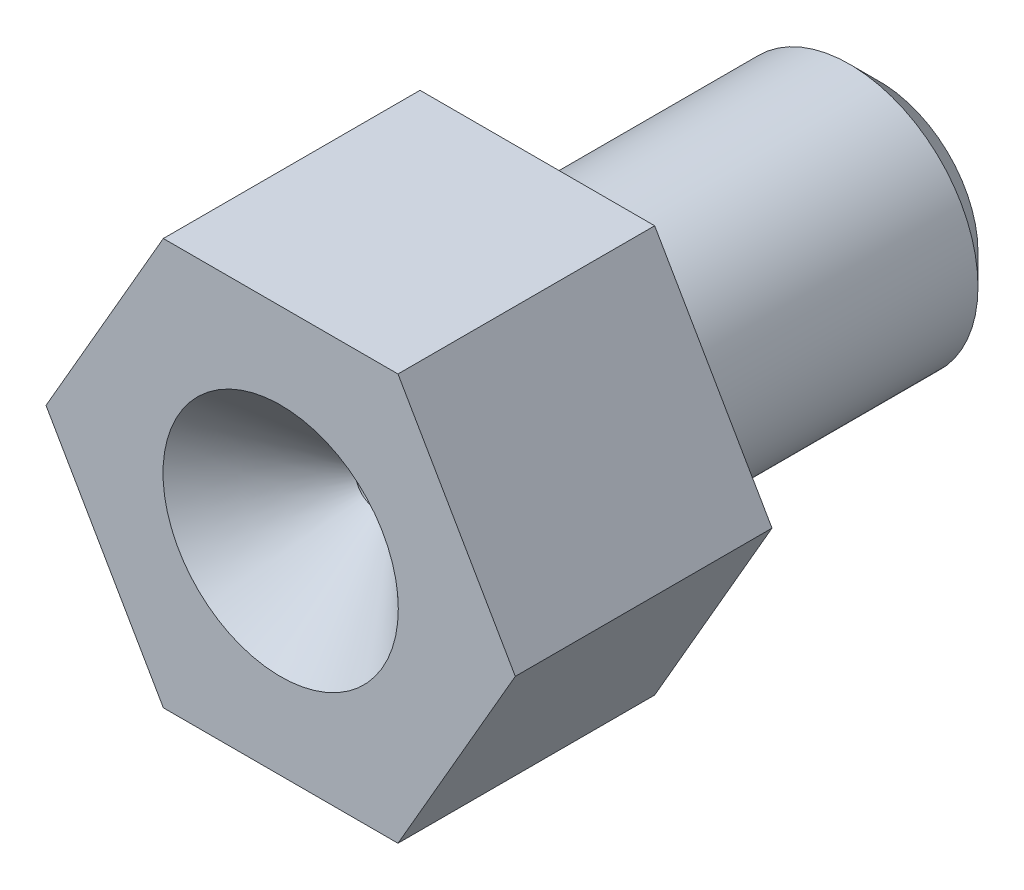
ISO-10303-21;
HEADER;
FILE_DESCRIPTION(('STEP AP214'),'2;1');
FILE_NAME('part.step','',(''),(''),'','','');
FILE_SCHEMA(('AUTOMOTIVE_DESIGN { 1 0 10303 214 1 1 1 1 }'));
ENDSEC;
DATA;
#1=APPLICATION_CONTEXT('core data for automotive mechanical design processes');
#2=APPLICATION_PROTOCOL_DEFINITION('international standard','automotive_design',2000,#1);
#3=PRODUCT_CONTEXT('',#1,'mechanical');
#4=PRODUCT('Part','Part','',(#3));
#5=PRODUCT_RELATED_PRODUCT_CATEGORY('part','',(#4));
#6=PRODUCT_DEFINITION_FORMATION('','',#4);
#7=PRODUCT_DEFINITION_CONTEXT('part definition',#1,'design');
#8=PRODUCT_DEFINITION('design','',#6,#7);
#9=PRODUCT_DEFINITION_SHAPE('','',#8);
#10=(LENGTH_UNIT() NAMED_UNIT(*) SI_UNIT(.MILLI.,.METRE.));
#11=(NAMED_UNIT(*) PLANE_ANGLE_UNIT() SI_UNIT($,.RADIAN.));
#12=(NAMED_UNIT(*) SI_UNIT($,.STERADIAN.) SOLID_ANGLE_UNIT());
#13=UNCERTAINTY_MEASURE_WITH_UNIT(LENGTH_MEASURE(1.E-05),#10,'distance_accuracy_value','');
#14=(GEOMETRIC_REPRESENTATION_CONTEXT(3) GLOBAL_UNCERTAINTY_ASSIGNED_CONTEXT((#13)) GLOBAL_UNIT_ASSIGNED_CONTEXT((#10,
#11,#12)) REPRESENTATION_CONTEXT('',''));
#15=CARTESIAN_POINT('',(0.,0.,0.));
#16=DIRECTION('',(0.,0.,1.));
#17=DIRECTION('',(1.,0.,0.));
#18=AXIS2_PLACEMENT_3D('',#15,#16,#17);
#19=CARTESIAN_POINT('',(0.,0.,8.));
#20=DIRECTION('',(0.,0.,-1.));
#21=DIRECTION('',(-1.,0.,0.));
#22=AXIS2_PLACEMENT_3D('',#19,#20,#21);
#23=CYLINDRICAL_SURFACE('',#22,0.25);
#24=CARTESIAN_POINT('',(0.,0.,1.00000000000001));
#25=DIRECTION('',(0.,0.,1.));
#26=DIRECTION('',(1.,0.,0.));
#27=AXIS2_PLACEMENT_3D('',#24,#25,#26);
#28=CIRCLE('',#27,0.25);
#29=CARTESIAN_POINT('',(-0.25,0.,1.00000000000001));
#30=VERTEX_POINT('',#29);
#31=EDGE_CURVE('E12',#30,#30,#28,.F.);
#32=ORIENTED_EDGE('',*,*,#31,.T.);
#33=EDGE_LOOP('',(#32));
#34=FACE_BOUND('',#33,.T.);
#35=CARTESIAN_POINT('',(0.,0.,4.));
#36=DIRECTION('',(0.,0.,1.));
#37=DIRECTION('',(1.,0.,0.));
#38=AXIS2_PLACEMENT_3D('',#35,#36,#37);
#39=CIRCLE('',#38,0.25);
#40=CARTESIAN_POINT('',(0.25,0.,4.));
#41=VERTEX_POINT('',#40);
#42=EDGE_CURVE('E134',#41,#41,#39,.T.);
#43=ORIENTED_EDGE('',*,*,#42,.T.);
#44=EDGE_LOOP('',(#43));
#45=FACE_BOUND('',#44,.T.);
#46=ADVANCED_FACE('F43',(#34,#45),#23,.F.);
#47=CARTESIAN_POINT('',(0.,0.,0.));
#48=DIRECTION('',(0.,0.,1.));
#49=DIRECTION('',(1.,0.,0.));
#50=AXIS2_PLACEMENT_3D('',#47,#48,#49);
#51=PLANE('',#50);
#52=CARTESIAN_POINT('',(0.,0.,0.));
#53=DIRECTION('',(0.,0.,1.));
#54=DIRECTION('',(1.,0.,0.));
#55=AXIS2_PLACEMENT_3D('',#52,#53,#54);
#56=CIRCLE('',#55,1.25);
#57=CARTESIAN_POINT('',(-1.25,0.,0.));
#58=VERTEX_POINT('',#57);
#59=EDGE_CURVE('E53',#58,#58,#56,.T.);
#60=ORIENTED_EDGE('',*,*,#59,.T.);
#61=EDGE_LOOP('',(#60));
#62=FACE_BOUND('',#61,.T.);
#63=CARTESIAN_POINT('',(0.,0.,0.));
#64=DIRECTION('',(0.,0.,1.));
#65=DIRECTION('',(1.,0.,0.));
#66=AXIS2_PLACEMENT_3D('',#63,#64,#65);
#67=CIRCLE('',#66,2.3);
#68=CARTESIAN_POINT('',(2.3,0.,0.));
#69=VERTEX_POINT('',#68);
#70=EDGE_CURVE('E156',#69,#69,#67,.F.);
#71=ORIENTED_EDGE('',*,*,#70,.T.);
#72=EDGE_LOOP('',(#71));
#73=FACE_BOUND('',#72,.T.);
#74=ADVANCED_FACE('F170',(#62,#73),#51,.F.);
#75=CARTESIAN_POINT('',(0.,0.,8.));
#76=DIRECTION('',(0.,0.,-1.));
#77=DIRECTION('',(-1.,0.,0.));
#78=AXIS2_PLACEMENT_3D('',#75,#76,#77);
#79=CYLINDRICAL_SURFACE('',#78,3.);
#80=CARTESIAN_POINT('',(0.,0.,0.700000000000002));
#81=DIRECTION('',(0.,0.,1.));
#82=DIRECTION('',(1.,0.,0.));
#83=AXIS2_PLACEMENT_3D('',#80,#81,#82);
#84=CIRCLE('',#83,3.);
#85=CARTESIAN_POINT('',(3.,0.,0.700000000000002));
#86=VERTEX_POINT('',#85);
#87=EDGE_CURVE('E153',#86,#86,#84,.T.);
#88=ORIENTED_EDGE('',*,*,#87,.T.);
#89=EDGE_LOOP('',(#88));
#90=FACE_BOUND('',#89,.T.);
#91=CARTESIAN_POINT('',(0.,0.,8.));
#92=DIRECTION('',(0.,0.,1.));
#93=DIRECTION('',(1.,0.,0.));
#94=AXIS2_PLACEMENT_3D('',#91,#92,#93);
#95=CIRCLE('',#94,3.);
#96=CARTESIAN_POINT('',(3.,0.,8.));
#97=VERTEX_POINT('',#96);
#98=EDGE_CURVE('E150',#97,#97,#95,.T.);
#99=ORIENTED_EDGE('',*,*,#98,.F.);
#100=EDGE_LOOP('',(#99));
#101=FACE_BOUND('',#100,.T.);
#102=ADVANCED_FACE('F188',(#90,#101),#79,.T.);
#103=CARTESIAN_POINT('',(0.,0.,0.700000000000002));
#104=DIRECTION('',(0.,0.,1.));
#105=DIRECTION('',(1.,0.,0.));
#106=AXIS2_PLACEMENT_3D('',#103,#104,#105);
#107=CONICAL_SURFACE('',#106,3.,0.78539816339745);
#108=ORIENTED_EDGE('',*,*,#70,.F.);
#109=EDGE_LOOP('',(#108));
#110=FACE_BOUND('',#109,.T.);
#111=ORIENTED_EDGE('',*,*,#87,.F.);
#112=EDGE_LOOP('',(#111));
#113=FACE_BOUND('',#112,.T.);
#114=ADVANCED_FACE('F197',(#110,#113),#107,.T.);
#115=CARTESIAN_POINT('',(0.,0.,14.));
#116=DIRECTION('',(0.,0.,1.));
#117=DIRECTION('',(1.,0.,0.));
#118=AXIS2_PLACEMENT_3D('',#115,#116,#117);
#119=PLANE('',#118);
#120=CARTESIAN_POINT('',(0.,0.,14.));
#121=DIRECTION('',(0.,0.,1.));
#122=DIRECTION('',(1.,0.,0.));
#123=AXIS2_PLACEMENT_3D('',#120,#121,#122);
#124=CIRCLE('',#123,2.75000000000001);
#125=CARTESIAN_POINT('',(2.75000000000001,0.,14.));
#126=VERTEX_POINT('',#125);
#127=EDGE_CURVE('E165',#126,#126,#124,.F.);
#128=ORIENTED_EDGE('',*,*,#127,.T.);
#129=EDGE_LOOP('',(#128));
#130=FACE_BOUND('',#129,.T.);
#131=DIRECTION('',(-0.5,0.866025403784438,0.));
#132=VECTOR('',#131,1.);
#133=CARTESIAN_POINT('',(5.48482755730145,0.,14.));
#134=LINE('',#133,#132);
#135=CARTESIAN_POINT('',(5.48482755730145,0.,14.));
#136=VERTEX_POINT('',#135);
#137=CARTESIAN_POINT('',(2.74241377865072,4.75,14.));
#138=VERTEX_POINT('',#137);
#139=EDGE_CURVE('E141',#136,#138,#134,.T.);
#140=ORIENTED_EDGE('',*,*,#139,.T.);
#141=DIRECTION('',(-1.,0.,0.));
#142=VECTOR('',#141,1.);
#143=CARTESIAN_POINT('',(2.74241377865072,4.75,14.));
#144=LINE('',#143,#142);
#145=CARTESIAN_POINT('',(-2.74241377865072,4.75,14.));
#146=VERTEX_POINT('',#145);
#147=EDGE_CURVE('E99',#138,#146,#144,.T.);
#148=ORIENTED_EDGE('',*,*,#147,.T.);
#149=DIRECTION('',(-0.5,-0.866025403784439,0.));
#150=VECTOR('',#149,1.);
#151=CARTESIAN_POINT('',(-2.74241377865072,4.75,14.));
#152=LINE('',#151,#150);
#153=CARTESIAN_POINT('',(-5.48482755730145,0.,14.));
#154=VERTEX_POINT('',#153);
#155=EDGE_CURVE('E112',#146,#154,#152,.T.);
#156=ORIENTED_EDGE('',*,*,#155,.T.);
#157=DIRECTION('',(0.5,-0.866025403784438,0.));
#158=VECTOR('',#157,1.);
#159=CARTESIAN_POINT('',(-5.48482755730145,0.,14.));
#160=LINE('',#159,#158);
#161=CARTESIAN_POINT('',(-2.74241377865072,-4.75,14.));
#162=VERTEX_POINT('',#161);
#163=EDGE_CURVE('E106',#154,#162,#160,.T.);
#164=ORIENTED_EDGE('',*,*,#163,.T.);
#165=DIRECTION('',(1.,0.,0.));
#166=VECTOR('',#165,1.);
#167=CARTESIAN_POINT('',(-2.74241377865072,-4.75,14.));
#168=LINE('',#167,#166);
#169=CARTESIAN_POINT('',(2.74241377865072,-4.75,14.));
#170=VERTEX_POINT('',#169);
#171=EDGE_CURVE('E110',#162,#170,#168,.T.);
#172=ORIENTED_EDGE('',*,*,#171,.T.);
#173=DIRECTION('',(0.5,0.866025403784439,0.));
#174=VECTOR('',#173,1.);
#175=CARTESIAN_POINT('',(2.74241377865072,-4.75,14.));
#176=LINE('',#175,#174);
#177=EDGE_CURVE('E61',#170,#136,#176,.T.);
#178=ORIENTED_EDGE('',*,*,#177,.T.);
#179=EDGE_LOOP('',(#140,#148,#156,#164,#172,#178));
#180=FACE_BOUND('',#179,.T.);
#181=ADVANCED_FACE('F108',(#130,#180),#119,.T.);
#182=CARTESIAN_POINT('',(0.,0.,8.));
#183=DIRECTION('',(0.,0.,1.));
#184=DIRECTION('',(1.,0.,0.));
#185=AXIS2_PLACEMENT_3D('',#182,#183,#184);
#186=PLANE('',#185);
#187=ORIENTED_EDGE('',*,*,#98,.T.);
#188=EDGE_LOOP('',(#187));
#189=FACE_BOUND('',#188,.T.);
#190=DIRECTION('',(-0.5,0.866025403784438,0.));
#191=VECTOR('',#190,1.);
#192=CARTESIAN_POINT('',(5.48482755730145,0.,8.));
#193=LINE('',#192,#191);
#194=CARTESIAN_POINT('',(5.48482755730145,0.,8.));
#195=VERTEX_POINT('',#194);
#196=CARTESIAN_POINT('',(2.74241377865072,4.75,8.));
#197=VERTEX_POINT('',#196);
#198=EDGE_CURVE('E130',#195,#197,#193,.T.);
#199=ORIENTED_EDGE('',*,*,#198,.F.);
#200=DIRECTION('',(0.5,0.866025403784439,0.));
#201=VECTOR('',#200,1.);
#202=CARTESIAN_POINT('',(2.74241377865072,-4.75,8.));
#203=LINE('',#202,#201);
#204=CARTESIAN_POINT('',(2.74241377865072,-4.75,8.));
#205=VERTEX_POINT('',#204);
#206=EDGE_CURVE('E90',#205,#195,#203,.T.);
#207=ORIENTED_EDGE('',*,*,#206,.F.);
#208=DIRECTION('',(1.,0.,0.));
#209=VECTOR('',#208,1.);
#210=CARTESIAN_POINT('',(-2.74241377865072,-4.75,8.));
#211=LINE('',#210,#209);
#212=CARTESIAN_POINT('',(-2.74241377865072,-4.75,8.));
#213=VERTEX_POINT('',#212);
#214=EDGE_CURVE('E84',#213,#205,#211,.T.);
#215=ORIENTED_EDGE('',*,*,#214,.F.);
#216=DIRECTION('',(0.5,-0.866025403784438,0.));
#217=VECTOR('',#216,1.);
#218=CARTESIAN_POINT('',(-5.48482755730145,0.,8.));
#219=LINE('',#218,#217);
#220=CARTESIAN_POINT('',(-5.48482755730145,0.,8.));
#221=VERTEX_POINT('',#220);
#222=EDGE_CURVE('E120',#221,#213,#219,.T.);
#223=ORIENTED_EDGE('',*,*,#222,.F.);
#224=DIRECTION('',(-0.5,-0.866025403784439,0.));
#225=VECTOR('',#224,1.);
#226=CARTESIAN_POINT('',(-2.74241377865072,4.75,8.));
#227=LINE('',#226,#225);
#228=CARTESIAN_POINT('',(-2.74241377865072,4.75,8.));
#229=VERTEX_POINT('',#228);
#230=EDGE_CURVE('E136',#229,#221,#227,.T.);
#231=ORIENTED_EDGE('',*,*,#230,.F.);
#232=DIRECTION('',(-1.,0.,0.));
#233=VECTOR('',#232,1.);
#234=CARTESIAN_POINT('',(2.74241377865072,4.75,8.));
#235=LINE('',#234,#233);
#236=EDGE_CURVE('E133',#197,#229,#235,.T.);
#237=ORIENTED_EDGE('',*,*,#236,.F.);
#238=EDGE_LOOP('',(#199,#207,#215,#223,#231,#237));
#239=FACE_BOUND('',#238,.T.);
#240=ADVANCED_FACE('F213',(#189,#239),#186,.F.);
#241=CARTESIAN_POINT('',(5.48482755730145,0.,14.));
#242=DIRECTION('',(-0.866025403784439,-0.5,0.));
#243=DIRECTION('',(0.5,-0.866025403784439,0.));
#244=AXIS2_PLACEMENT_3D('',#241,#242,#243);
#245=PLANE('',#244);
#246=ORIENTED_EDGE('',*,*,#198,.T.);
#247=DIRECTION('',(0.,0.,-1.));
#248=VECTOR('',#247,1.);
#249=CARTESIAN_POINT('',(2.74241377865072,4.75,14.));
#250=LINE('',#249,#248);
#251=EDGE_CURVE('E148',#138,#197,#250,.T.);
#252=ORIENTED_EDGE('',*,*,#251,.F.);
#253=ORIENTED_EDGE('',*,*,#139,.F.);
#254=DIRECTION('',(0.,0.,-1.));
#255=VECTOR('',#254,1.);
#256=CARTESIAN_POINT('',(5.48482755730145,0.,14.));
#257=LINE('',#256,#255);
#258=EDGE_CURVE('E126',#136,#195,#257,.T.);
#259=ORIENTED_EDGE('',*,*,#258,.T.);
#260=EDGE_LOOP('',(#246,#252,#253,#259));
#261=FACE_BOUND('',#260,.T.);
#262=ADVANCED_FACE('F192',(#261),#245,.F.);
#263=CARTESIAN_POINT('',(2.74241377865072,4.75,14.));
#264=DIRECTION('',(0.,-1.,0.));
#265=DIRECTION('',(0.,0.,-1.));
#266=AXIS2_PLACEMENT_3D('',#263,#264,#265);
#267=PLANE('',#266);
#268=ORIENTED_EDGE('',*,*,#236,.T.);
#269=DIRECTION('',(0.,0.,-1.));
#270=VECTOR('',#269,1.);
#271=CARTESIAN_POINT('',(-2.74241377865072,4.75,14.));
#272=LINE('',#271,#270);
#273=EDGE_CURVE('E145',#146,#229,#272,.T.);
#274=ORIENTED_EDGE('',*,*,#273,.F.);
#275=ORIENTED_EDGE('',*,*,#147,.F.);
#276=ORIENTED_EDGE('',*,*,#251,.T.);
#277=EDGE_LOOP('',(#268,#274,#275,#276));
#278=FACE_BOUND('',#277,.T.);
#279=ADVANCED_FACE('F246',(#278),#267,.F.);
#280=CARTESIAN_POINT('',(-2.74241377865072,4.75,14.));
#281=DIRECTION('',(0.866025403784439,-0.5,0.));
#282=DIRECTION('',(0.5,0.866025403784439,0.));
#283=AXIS2_PLACEMENT_3D('',#280,#281,#282);
#284=PLANE('',#283);
#285=ORIENTED_EDGE('',*,*,#230,.T.);
#286=DIRECTION('',(0.,0.,-1.));
#287=VECTOR('',#286,1.);
#288=CARTESIAN_POINT('',(-5.48482755730145,0.,14.));
#289=LINE('',#288,#287);
#290=EDGE_CURVE('E121',#154,#221,#289,.T.);
#291=ORIENTED_EDGE('',*,*,#290,.F.);
#292=ORIENTED_EDGE('',*,*,#155,.F.);
#293=ORIENTED_EDGE('',*,*,#273,.T.);
#294=EDGE_LOOP('',(#285,#291,#292,#293));
#295=FACE_BOUND('',#294,.T.);
#296=ADVANCED_FACE('F244',(#295),#284,.F.);
#297=CARTESIAN_POINT('',(-5.48482755730145,0.,14.));
#298=DIRECTION('',(0.866025403784438,0.500000000000001,0.));
#299=DIRECTION('',(-0.500000000000001,0.866025403784438,0.));
#300=AXIS2_PLACEMENT_3D('',#297,#298,#299);
#301=PLANE('',#300);
#302=ORIENTED_EDGE('',*,*,#222,.T.);
#303=DIRECTION('',(0.,0.,-1.));
#304=VECTOR('',#303,1.);
#305=CARTESIAN_POINT('',(-2.74241377865072,-4.75,14.));
#306=LINE('',#305,#304);
#307=EDGE_CURVE('E117',#162,#213,#306,.T.);
#308=ORIENTED_EDGE('',*,*,#307,.F.);
#309=ORIENTED_EDGE('',*,*,#163,.F.);
#310=ORIENTED_EDGE('',*,*,#290,.T.);
#311=EDGE_LOOP('',(#302,#308,#309,#310));
#312=FACE_BOUND('',#311,.T.);
#313=ADVANCED_FACE('F118',(#312),#301,.F.);
#314=CARTESIAN_POINT('',(-2.74241377865072,-4.75,14.));
#315=DIRECTION('',(0.,1.,0.));
#316=DIRECTION('',(-1.,0.,0.));
#317=AXIS2_PLACEMENT_3D('',#314,#315,#316);
#318=PLANE('',#317);
#319=ORIENTED_EDGE('',*,*,#214,.T.);
#320=DIRECTION('',(0.,0.,-1.));
#321=VECTOR('',#320,1.);
#322=CARTESIAN_POINT('',(2.74241377865072,-4.75,14.));
#323=LINE('',#322,#321);
#324=EDGE_CURVE('E122',#170,#205,#323,.T.);
#325=ORIENTED_EDGE('',*,*,#324,.F.);
#326=ORIENTED_EDGE('',*,*,#171,.F.);
#327=ORIENTED_EDGE('',*,*,#307,.T.);
#328=EDGE_LOOP('',(#319,#325,#326,#327));
#329=FACE_BOUND('',#328,.T.);
#330=ADVANCED_FACE('F124',(#329),#318,.F.);
#331=CARTESIAN_POINT('',(2.74241377865072,-4.75,14.));
#332=DIRECTION('',(-0.866025403784439,0.5,0.));
#333=DIRECTION('',(-0.5,-0.866025403784439,0.));
#334=AXIS2_PLACEMENT_3D('',#331,#332,#333);
#335=PLANE('',#334);
#336=ORIENTED_EDGE('',*,*,#206,.T.);
#337=ORIENTED_EDGE('',*,*,#258,.F.);
#338=ORIENTED_EDGE('',*,*,#177,.F.);
#339=ORIENTED_EDGE('',*,*,#324,.T.);
#340=EDGE_LOOP('',(#336,#337,#338,#339));
#341=FACE_BOUND('',#340,.T.);
#342=ADVANCED_FACE('F229',(#341),#335,.F.);
#343=CARTESIAN_POINT('',(0.,0.,-1.41421356237309));
#344=DIRECTION('',(0.,0.,1.));
#345=DIRECTION('',(1.,0.,0.));
#346=AXIS2_PLACEMENT_3D('',#343,#344,#345);
#347=CYLINDRICAL_SURFACE('',#346,0.5);
#348=CARTESIAN_POINT('',(0.,0.,11.75));
#349=DIRECTION('',(0.,0.,1.));
#350=DIRECTION('',(1.,0.,0.));
#351=AXIS2_PLACEMENT_3D('',#348,#349,#350);
#352=CIRCLE('',#351,0.5);
#353=CARTESIAN_POINT('',(0.499999999999999,0.,11.75));
#354=VERTEX_POINT('',#353);
#355=EDGE_CURVE('E159',#354,#354,#352,.T.);
#356=ORIENTED_EDGE('',*,*,#355,.T.);
#357=EDGE_LOOP('',(#356));
#358=FACE_BOUND('',#357,.T.);
#359=CARTESIAN_POINT('',(0.,0.,4.));
#360=DIRECTION('',(0.,0.,1.));
#361=DIRECTION('',(1.,0.,0.));
#362=AXIS2_PLACEMENT_3D('',#359,#360,#361);
#363=CIRCLE('',#362,0.5);
#364=CARTESIAN_POINT('',(0.5,0.,4.));
#365=VERTEX_POINT('',#364);
#366=EDGE_CURVE('E162',#365,#365,#363,.F.);
#367=ORIENTED_EDGE('',*,*,#366,.T.);
#368=EDGE_LOOP('',(#367));
#369=FACE_BOUND('',#368,.T.);
#370=ADVANCED_FACE('F231',(#358,#369),#347,.F.);
#371=CARTESIAN_POINT('',(0.,0.,4.));
#372=DIRECTION('',(0.,0.,1.));
#373=DIRECTION('',(1.,0.,0.));
#374=AXIS2_PLACEMENT_3D('',#371,#372,#373);
#375=PLANE('',#374);
#376=ORIENTED_EDGE('',*,*,#42,.F.);
#377=EDGE_LOOP('',(#376));
#378=FACE_BOUND('',#377,.T.);
#379=ORIENTED_EDGE('',*,*,#366,.F.);
#380=EDGE_LOOP('',(#379));
#381=FACE_BOUND('',#380,.T.);
#382=ADVANCED_FACE('F180',(#378,#381),#375,.T.);
#383=CARTESIAN_POINT('',(0.,0.,11.75));
#384=DIRECTION('',(0.,0.,1.));
#385=DIRECTION('',(1.,0.,0.));
#386=AXIS2_PLACEMENT_3D('',#383,#384,#385);
#387=CONICAL_SURFACE('',#386,0.5,0.78539816339745);
#388=CARTESIAN_POINT('',(2.75000000000001,0.,14.));
#389=CARTESIAN_POINT('',(2.72656250000001,0.,13.9765625));
#390=CARTESIAN_POINT('',(2.70312500000001,0.,13.953125));
#391=CARTESIAN_POINT('',(2.65625000000001,0.,13.90625));
#392=CARTESIAN_POINT('',(2.63281250000001,0.,13.8828125));
#393=CARTESIAN_POINT('',(2.58593750000001,0.,13.8359375));
#394=CARTESIAN_POINT('',(2.56250000000001,0.,13.8125));
#395=CARTESIAN_POINT('',(2.51562500000001,0.,13.765625));
#396=CARTESIAN_POINT('',(2.49218750000001,0.,13.7421875));
#397=CARTESIAN_POINT('',(2.44531250000001,0.,13.6953125));
#398=CARTESIAN_POINT('',(2.42187500000001,0.,13.671875));
#399=CARTESIAN_POINT('',(2.37500000000001,0.,13.625));
#400=CARTESIAN_POINT('',(2.35156250000001,0.,13.6015625));
#401=CARTESIAN_POINT('',(2.30468750000001,0.,13.5546875));
#402=CARTESIAN_POINT('',(2.28125000000001,0.,13.53125));
#403=CARTESIAN_POINT('',(2.23437500000001,0.,13.484375));
#404=CARTESIAN_POINT('',(2.21093750000001,0.,13.4609375));
#405=CARTESIAN_POINT('',(2.16406250000001,0.,13.4140625));
#406=CARTESIAN_POINT('',(2.14062500000001,0.,13.390625));
#407=CARTESIAN_POINT('',(2.09375000000001,0.,13.34375));
#408=CARTESIAN_POINT('',(2.07031250000001,0.,13.3203125));
#409=CARTESIAN_POINT('',(2.02343750000001,0.,13.2734375));
#410=CARTESIAN_POINT('',(2.00000000000001,0.,13.25));
#411=CARTESIAN_POINT('',(1.95312500000001,0.,13.203125));
#412=CARTESIAN_POINT('',(1.92968750000001,0.,13.1796875));
#413=CARTESIAN_POINT('',(1.88281250000001,0.,13.1328125));
#414=CARTESIAN_POINT('',(1.85937500000001,0.,13.109375));
#415=CARTESIAN_POINT('',(1.81250000000001,0.,13.0625));
#416=CARTESIAN_POINT('',(1.78906250000001,0.,13.0390625));
#417=CARTESIAN_POINT('',(1.74218750000001,0.,12.9921875));
#418=CARTESIAN_POINT('',(1.71875,0.,12.96875));
#419=CARTESIAN_POINT('',(1.671875,0.,12.921875));
#420=CARTESIAN_POINT('',(1.6484375,0.,12.8984375));
#421=CARTESIAN_POINT('',(1.6015625,0.,12.8515625));
#422=CARTESIAN_POINT('',(1.578125,0.,12.828125));
#423=CARTESIAN_POINT('',(1.53125,0.,12.78125));
#424=CARTESIAN_POINT('',(1.5078125,0.,12.7578125));
#425=CARTESIAN_POINT('',(1.4609375,0.,12.7109375));
#426=CARTESIAN_POINT('',(1.4375,0.,12.6875));
#427=CARTESIAN_POINT('',(1.390625,0.,12.640625));
#428=CARTESIAN_POINT('',(1.3671875,0.,12.6171875));
#429=CARTESIAN_POINT('',(1.3203125,0.,12.5703125));
#430=CARTESIAN_POINT('',(1.296875,0.,12.546875));
#431=CARTESIAN_POINT('',(1.25,0.,12.5));
#432=CARTESIAN_POINT('',(1.2265625,0.,12.4765625));
#433=CARTESIAN_POINT('',(1.1796875,0.,12.4296875));
#434=CARTESIAN_POINT('',(1.15625,0.,12.40625));
#435=CARTESIAN_POINT('',(1.109375,0.,12.359375));
#436=CARTESIAN_POINT('',(1.0859375,0.,12.3359375));
#437=CARTESIAN_POINT('',(1.0390625,0.,12.2890625));
#438=CARTESIAN_POINT('',(1.015625,0.,12.265625));
#439=CARTESIAN_POINT('',(0.968750000000002,0.,12.21875));
#440=CARTESIAN_POINT('',(0.945312500000001,0.,12.1953125));
#441=CARTESIAN_POINT('',(0.898437500000001,0.,12.1484375));
#442=CARTESIAN_POINT('',(0.875000000000001,0.,12.125));
#443=CARTESIAN_POINT('',(0.828125000000001,0.,12.078125));
#444=CARTESIAN_POINT('',(0.8046875,0.,12.0546875));
#445=CARTESIAN_POINT('',(0.7578125,0.,12.0078125));
#446=CARTESIAN_POINT('',(0.734375000000001,0.,11.984375));
#447=CARTESIAN_POINT('',(0.6875,0.,11.9375));
#448=CARTESIAN_POINT('',(0.6640625,0.,11.9140625));
#449=CARTESIAN_POINT('',(0.617187499999999,0.,11.8671875));
#450=CARTESIAN_POINT('',(0.593749999999999,0.,11.84375));
#451=CARTESIAN_POINT('',(0.546875,0.,11.796875));
#452=CARTESIAN_POINT('',(0.523437499999999,0.,11.7734375));
#453=CARTESIAN_POINT('',(0.499999999999999,0.,11.75));
#454=B_SPLINE_CURVE_WITH_KNOTS('',3,(#388,#389,#390,#391,#392,#393,#394,#395,#396,#397,#398,
#399,#400,#401,#402,#403,#404,#405,#406,#407,#408,#409,#410,#411,#412,#413,#414,#415,#416,#417,
#418,#419,#420,#421,#422,#423,#424,#425,#426,#427,#428,#429,#430,#431,#432,#433,#434,#435,#436,
#437,#438,#439,#440,#441,#442,#443,#444,#445,#446,#447,#448,#449,#450,#451,#452,#453),
.UNSPECIFIED.,.F.,.F.,(4,2,2,2,2,2,2,2,2,2,2,2,2,2,2,2,2,2,2,2,2,2,2,2,2,2,2,2,2,2,2,2,4),(0.,
0.099436891104358,0.198873782208716,0.298310673313075,0.397747564417434,0.497184455521792,
0.596621346626151,0.69605823773051,0.795495128834869,0.894932019939226,0.994368911043585,
1.09380580214794,1.1932426932523,1.29267958435666,1.39211647546102,1.49155336656538,
1.59099025766974,1.6904271487741,1.78986403987845,1.88930093098281,1.98873782208717,
2.08817471319153,2.18761160429589,2.28704849540025,2.38648538650461,2.48592227760896,
2.58535916871332,2.68479605981768,2.78423295092204,2.8836698420264,2.98310673313076,
3.08254362423512,3.18198051533948),.UNSPECIFIED.);
#455=EDGE_CURVE('BSEAM174',#126,#354,#454,.T.);
#456=ORIENTED_EDGE('',*,*,#127,.F.);
#457=ORIENTED_EDGE('',*,*,#355,.F.);
#458=ORIENTED_EDGE('',*,*,#455,.T.);
#459=ORIENTED_EDGE('',*,*,#455,.F.);
#460=EDGE_LOOP('',(#456,#458,#457,#459));
#461=FACE_BOUND('',#460,.T.);
#462=ADVANCED_FACE('F174',(#461),#387,.F.);
#463=CARTESIAN_POINT('',(0.,0.,0.));
#464=DIRECTION('',(0.,0.,-1.));
#465=DIRECTION('',(-1.,0.,0.));
#466=AXIS2_PLACEMENT_3D('',#463,#464,#465);
#467=CONICAL_SURFACE('',#466,1.25,0.785398163397446);
#468=CARTESIAN_POINT('',(-0.25,0.,1.00000000000001));
#469=CARTESIAN_POINT('',(-0.260416666666667,0.,0.989583333333338));
#470=CARTESIAN_POINT('',(-0.270833333333333,0.,0.979166666666672));
#471=CARTESIAN_POINT('',(-0.291666666666667,0.,0.958333333333338));
#472=CARTESIAN_POINT('',(-0.302083333333333,0.,0.947916666666672));
#473=CARTESIAN_POINT('',(-0.322916666666667,0.,0.927083333333338));
#474=CARTESIAN_POINT('',(-0.333333333333333,0.,0.916666666666671));
#475=CARTESIAN_POINT('',(-0.354166666666667,0.,0.895833333333338));
#476=CARTESIAN_POINT('',(-0.364583333333333,0.,0.885416666666671));
#477=CARTESIAN_POINT('',(-0.385416666666667,0.,0.864583333333338));
#478=CARTESIAN_POINT('',(-0.395833333333333,0.,0.854166666666671));
#479=CARTESIAN_POINT('',(-0.416666666666667,0.,0.833333333333338));
#480=CARTESIAN_POINT('',(-0.427083333333334,0.,0.822916666666671));
#481=CARTESIAN_POINT('',(-0.447916666666667,0.,0.802083333333337));
#482=CARTESIAN_POINT('',(-0.458333333333334,0.,0.791666666666671));
#483=CARTESIAN_POINT('',(-0.479166666666667,0.,0.770833333333337));
#484=CARTESIAN_POINT('',(-0.489583333333334,0.,0.760416666666671));
#485=CARTESIAN_POINT('',(-0.510416666666667,0.,0.739583333333337));
#486=CARTESIAN_POINT('',(-0.520833333333334,0.,0.729166666666671));
#487=CARTESIAN_POINT('',(-0.541666666666667,0.,0.708333333333337));
#488=CARTESIAN_POINT('',(-0.552083333333334,0.,0.69791666666667));
#489=CARTESIAN_POINT('',(-0.572916666666667,0.,0.677083333333337));
#490=CARTESIAN_POINT('',(-0.583333333333334,0.,0.66666666666667));
#491=CARTESIAN_POINT('',(-0.604166666666667,0.,0.645833333333337));
#492=CARTESIAN_POINT('',(-0.614583333333334,0.,0.63541666666667));
#493=CARTESIAN_POINT('',(-0.635416666666667,0.,0.614583333333337));
#494=CARTESIAN_POINT('',(-0.645833333333334,0.,0.60416666666667));
#495=CARTESIAN_POINT('',(-0.666666666666667,0.,0.583333333333336));
#496=CARTESIAN_POINT('',(-0.677083333333334,0.,0.57291666666667));
#497=CARTESIAN_POINT('',(-0.697916666666667,0.,0.552083333333336));
#498=CARTESIAN_POINT('',(-0.708333333333334,0.,0.541666666666669));
#499=CARTESIAN_POINT('',(-0.729166666666667,0.,0.520833333333336));
#500=CARTESIAN_POINT('',(-0.739583333333334,0.,0.510416666666669));
#501=CARTESIAN_POINT('',(-0.760416666666667,0.,0.489583333333336));
#502=CARTESIAN_POINT('',(-0.770833333333334,0.,0.479166666666669));
#503=CARTESIAN_POINT('',(-0.791666666666667,0.,0.458333333333336));
#504=CARTESIAN_POINT('',(-0.802083333333334,0.,0.447916666666669));
#505=CARTESIAN_POINT('',(-0.822916666666667,0.,0.427083333333336));
#506=CARTESIAN_POINT('',(-0.833333333333334,0.,0.416666666666669));
#507=CARTESIAN_POINT('',(-0.854166666666667,0.,0.395833333333335));
#508=CARTESIAN_POINT('',(-0.864583333333334,0.,0.385416666666669));
#509=CARTESIAN_POINT('',(-0.885416666666667,0.,0.364583333333335));
#510=CARTESIAN_POINT('',(-0.895833333333334,0.,0.354166666666669));
#511=CARTESIAN_POINT('',(-0.916666666666667,0.,0.333333333333335));
#512=CARTESIAN_POINT('',(-0.927083333333334,0.,0.322916666666668));
#513=CARTESIAN_POINT('',(-0.947916666666668,0.,0.302083333333335));
#514=CARTESIAN_POINT('',(-0.958333333333334,0.,0.291666666666668));
#515=CARTESIAN_POINT('',(-0.979166666666668,0.,0.270833333333335));
#516=CARTESIAN_POINT('',(-0.989583333333334,0.,0.260416666666668));
#517=CARTESIAN_POINT('',(-1.01041666666667,0.,0.239583333333335));
#518=CARTESIAN_POINT('',(-1.02083333333333,0.,0.229166666666668));
#519=CARTESIAN_POINT('',(-1.04166666666667,0.,0.208333333333334));
#520=CARTESIAN_POINT('',(-1.05208333333333,0.,0.197916666666668));
#521=CARTESIAN_POINT('',(-1.07291666666667,0.,0.177083333333334));
#522=CARTESIAN_POINT('',(-1.08333333333333,0.,0.166666666666668));
#523=CARTESIAN_POINT('',(-1.10416666666667,0.,0.145833333333334));
#524=CARTESIAN_POINT('',(-1.11458333333333,0.,0.135416666666667));
#525=CARTESIAN_POINT('',(-1.13541666666667,0.,0.114583333333334));
#526=CARTESIAN_POINT('',(-1.14583333333333,0.,0.104166666666667));
#527=CARTESIAN_POINT('',(-1.16666666666667,0.,0.0833333333333338));
#528=CARTESIAN_POINT('',(-1.17708333333333,0.,0.072916666666667));
#529=CARTESIAN_POINT('',(-1.19791666666667,0.,0.0520833333333335));
#530=CARTESIAN_POINT('',(-1.20833333333333,0.,0.0416666666666668));
#531=CARTESIAN_POINT('',(-1.22916666666667,0.,0.0208333333333334));
#532=CARTESIAN_POINT('',(-1.23958333333333,0.,0.0104166666666667));
#533=CARTESIAN_POINT('',(-1.25,0.,0.));
#534=B_SPLINE_CURVE_WITH_KNOTS('',3,(#468,#469,#470,#471,#472,#473,#474,#475,#476,#477,#478,
#479,#480,#481,#482,#483,#484,#485,#486,#487,#488,#489,#490,#491,#492,#493,#494,#495,#496,#497,
#498,#499,#500,#501,#502,#503,#504,#505,#506,#507,#508,#509,#510,#511,#512,#513,#514,#515,#516,
#517,#518,#519,#520,#521,#522,#523,#524,#525,#526,#527,#528,#529,#530,#531,#532,#533),
.UNSPECIFIED.,.F.,.F.,(4,2,2,2,2,2,2,2,2,2,2,2,2,2,2,2,2,2,2,2,2,2,2,2,2,2,2,2,2,2,2,2,4),(0.,
0.0441941738241593,0.0883883476483187,0.132582521472478,0.176776695296637,0.220970869120797,
0.265165042944956,0.309359216769116,0.353553390593275,0.397747564417434,0.441941738241593,
0.486135912065753,0.530330085889912,0.574524259714072,0.618718433538231,0.662912607362391,
0.70710678118655,0.751300955010709,0.795495128834868,0.839689302659028,0.883883476483187,
0.928077650307347,0.972271824131506,1.01646599795567,1.06066017177982,1.10485434560398,
1.14904851942814,1.1932426932523,1.23743686707646,1.28163104090062,1.32582521472478,
1.37001938854894,1.4142135623731),.UNSPECIFIED.);
#535=EDGE_CURVE('BSEAM46',#30,#58,#534,.T.);
#536=ORIENTED_EDGE('',*,*,#31,.F.);
#537=ORIENTED_EDGE('',*,*,#59,.F.);
#538=ORIENTED_EDGE('',*,*,#535,.T.);
#539=ORIENTED_EDGE('',*,*,#535,.F.);
#540=EDGE_LOOP('',(#536,#538,#537,#539));
#541=FACE_BOUND('',#540,.T.);
#542=ADVANCED_FACE('F46',(#541),#467,.F.);
#543=CLOSED_SHELL('',(#46,#74,#102,#114,#181,#240,#262,#279,#296,#313,#330,#342,#370,#382,#462,#542));
#544=MANIFOLD_SOLID_BREP('B2',#543);
#545=ADVANCED_BREP_SHAPE_REPRESENTATION('',(#18,#544),#14);
#546=SHAPE_DEFINITION_REPRESENTATION(#9,#545);
ENDSEC;
END-ISO-10303-21;
